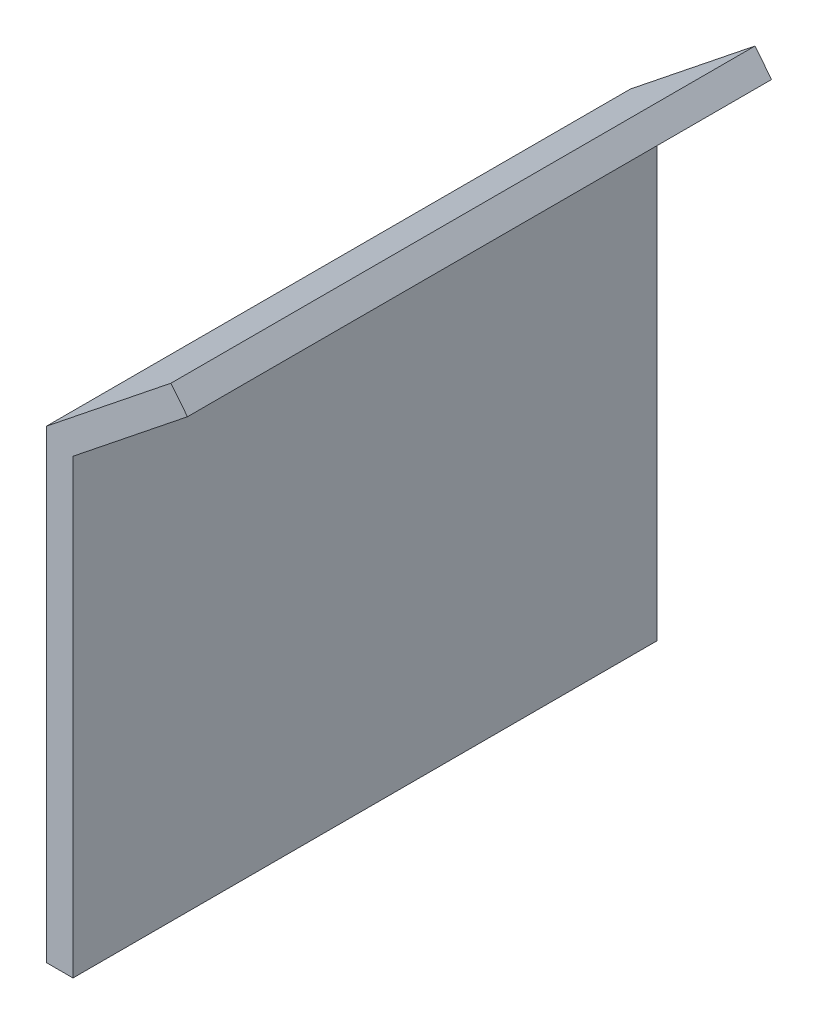
ISO-10303-21;
HEADER;
FILE_DESCRIPTION(('STEP AP214'),'2;1');
FILE_NAME('part.step','',(''),(''),'','','');
FILE_SCHEMA(('AUTOMOTIVE_DESIGN { 1 0 10303 214 1 1 1 1 }'));
ENDSEC;
DATA;
#1=APPLICATION_CONTEXT('core data for automotive mechanical design processes');
#2=APPLICATION_PROTOCOL_DEFINITION('international standard','automotive_design',2000,#1);
#3=PRODUCT_CONTEXT('',#1,'mechanical');
#4=PRODUCT('Part','Part','',(#3));
#5=PRODUCT_RELATED_PRODUCT_CATEGORY('part','',(#4));
#6=PRODUCT_DEFINITION_FORMATION('','',#4);
#7=PRODUCT_DEFINITION_CONTEXT('part definition',#1,'design');
#8=PRODUCT_DEFINITION('design','',#6,#7);
#9=PRODUCT_DEFINITION_SHAPE('','',#8);
#10=(LENGTH_UNIT() NAMED_UNIT(*) SI_UNIT(.MILLI.,.METRE.));
#11=(NAMED_UNIT(*) PLANE_ANGLE_UNIT() SI_UNIT($,.RADIAN.));
#12=(NAMED_UNIT(*) SI_UNIT($,.STERADIAN.) SOLID_ANGLE_UNIT());
#13=UNCERTAINTY_MEASURE_WITH_UNIT(LENGTH_MEASURE(1.E-05),#10,'distance_accuracy_value','');
#14=(GEOMETRIC_REPRESENTATION_CONTEXT(3) GLOBAL_UNCERTAINTY_ASSIGNED_CONTEXT((#13)) GLOBAL_UNIT_ASSIGNED_CONTEXT((#10,
#11,#12)) REPRESENTATION_CONTEXT('',''));
#15=CARTESIAN_POINT('',(0.,0.,0.));
#16=DIRECTION('',(0.,0.,1.));
#17=DIRECTION('',(1.,0.,0.));
#18=AXIS2_PLACEMENT_3D('',#15,#16,#17);
#19=CARTESIAN_POINT('',(0.,0.,0.));
#20=DIRECTION('',(0.,0.,1.));
#21=DIRECTION('',(1.,0.,0.));
#22=AXIS2_PLACEMENT_3D('',#19,#20,#21);
#23=PLANE('',#22);
#24=DIRECTION('',(1.,0.,0.));
#25=VECTOR('',#24,1.);
#26=CARTESIAN_POINT('',(-97.8410238780608,50.4529528721964,0.));
#27=LINE('',#26,#25);
#28=CARTESIAN_POINT('',(-97.8410238780608,50.4529528721964,0.));
#29=VERTEX_POINT('',#28);
#30=CARTESIAN_POINT('',(-95.8410238780608,50.4529528721963,0.));
#31=VERTEX_POINT('',#30);
#32=EDGE_CURVE('E101',#29,#31,#27,.T.);
#33=ORIENTED_EDGE('',*,*,#32,.F.);
#34=DIRECTION('',(0.,-1.,0.));
#35=VECTOR('',#34,1.);
#36=CARTESIAN_POINT('',(-97.8410238780608,85.4529528721964,0.));
#37=LINE('',#36,#35);
#38=CARTESIAN_POINT('',(-97.8410238780608,85.4529528721964,0.));
#39=VERTEX_POINT('',#38);
#40=EDGE_CURVE('E119',#39,#29,#37,.T.);
#41=ORIENTED_EDGE('',*,*,#40,.F.);
#42=DIRECTION('',(-0.781290028461833,-0.624168159574091,0.));
#43=VECTOR('',#42,1.);
#44=CARTESIAN_POINT('',(-88.4655435365188,92.9429707870855,0.));
#45=LINE('',#44,#43);
#46=CARTESIAN_POINT('',(-88.4655435365188,92.9429707870855,0.));
#47=VERTEX_POINT('',#46);
#48=EDGE_CURVE('E116',#47,#39,#45,.T.);
#49=ORIENTED_EDGE('',*,*,#48,.F.);
#50=DIRECTION('',(-0.624168159574091,0.781290028461833,0.));
#51=VECTOR('',#50,1.);
#52=CARTESIAN_POINT('',(-87.2172072173706,91.3803907301618,0.));
#53=LINE('',#52,#51);
#54=CARTESIAN_POINT('',(-87.2172072173706,91.3803907301618,0.));
#55=VERTEX_POINT('',#54);
#56=EDGE_CURVE('E113',#55,#47,#53,.T.);
#57=ORIENTED_EDGE('',*,*,#56,.F.);
#58=DIRECTION('',(0.781290028461832,0.624168159574092,0.));
#59=VECTOR('',#58,1.);
#60=CARTESIAN_POINT('',(-95.8410238780608,84.4908726542629,0.));
#61=LINE('',#60,#59);
#62=CARTESIAN_POINT('',(-95.8410238780608,84.4908726542629,0.));
#63=VERTEX_POINT('',#62);
#64=EDGE_CURVE('E104',#63,#55,#61,.T.);
#65=ORIENTED_EDGE('',*,*,#64,.F.);
#66=DIRECTION('',(0.,1.,0.));
#67=VECTOR('',#66,1.);
#68=CARTESIAN_POINT('',(-95.8410238780608,50.4529528721963,0.));
#69=LINE('',#68,#67);
#70=EDGE_CURVE('E93',#31,#63,#69,.T.);
#71=ORIENTED_EDGE('',*,*,#70,.F.);
#72=EDGE_LOOP('',(#33,#41,#49,#57,#65,#71));
#73=FACE_BOUND('',#72,.T.);
#74=ADVANCED_FACE('F37',(#73),#23,.F.);
#75=CARTESIAN_POINT('',(-97.8410238780608,85.4529528721964,87.7980262437425));
#76=DIRECTION('',(1.,0.,0.));
#77=DIRECTION('',(0.,0.,-1.));
#78=AXIS2_PLACEMENT_3D('',#75,#76,#77);
#79=PLANE('',#78);
#80=DIRECTION('',(0.,0.,-1.));
#81=VECTOR('',#80,1.);
#82=CARTESIAN_POINT('',(-97.8410238780608,50.4529528721964,87.7980262437425));
#83=LINE('',#82,#81);
#84=CARTESIAN_POINT('',(-97.8410238780608,50.4529528721964,44.));
#85=VERTEX_POINT('',#84);
#86=EDGE_CURVE('E107',#85,#29,#83,.T.);
#87=ORIENTED_EDGE('',*,*,#86,.F.);
#88=DIRECTION('',(0.,1.,0.));
#89=VECTOR('',#88,1.);
#90=CARTESIAN_POINT('',(-97.8410238780608,85.4529528721964,44.));
#91=LINE('',#90,#89);
#92=CARTESIAN_POINT('',(-97.8410238780608,85.4529528721964,44.));
#93=VERTEX_POINT('',#92);
#94=EDGE_CURVE('E41',#85,#93,#91,.T.);
#95=ORIENTED_EDGE('',*,*,#94,.T.);
#96=DIRECTION('',(0.,0.,-1.));
#97=VECTOR('',#96,1.);
#98=CARTESIAN_POINT('',(-97.8410238780608,85.4529528721964,87.7980262437425));
#99=LINE('',#98,#97);
#100=EDGE_CURVE('E122',#93,#39,#99,.T.);
#101=ORIENTED_EDGE('',*,*,#100,.T.);
#102=ORIENTED_EDGE('',*,*,#40,.T.);
#103=EDGE_LOOP('',(#87,#95,#101,#102));
#104=FACE_BOUND('',#103,.T.);
#105=ADVANCED_FACE('F141',(#104),#79,.F.);
#106=CARTESIAN_POINT('',(-88.4655435365188,92.9429707870855,87.7980262437425));
#107=DIRECTION('',(0.624168159574091,-0.781290028461833,0.));
#108=DIRECTION('',(0.781290028461833,0.624168159574091,0.));
#109=AXIS2_PLACEMENT_3D('',#106,#107,#108);
#110=PLANE('',#109);
#111=ORIENTED_EDGE('',*,*,#100,.F.);
#112=DIRECTION('',(0.781290028461833,0.624168159574091,0.));
#113=VECTOR('',#112,1.);
#114=CARTESIAN_POINT('',(-88.4655435365188,92.9429707870855,44.));
#115=LINE('',#114,#113);
#116=CARTESIAN_POINT('',(-88.4655435365188,92.9429707870855,44.));
#117=VERTEX_POINT('',#116);
#118=EDGE_CURVE('E133',#93,#117,#115,.T.);
#119=ORIENTED_EDGE('',*,*,#118,.T.);
#120=DIRECTION('',(0.,0.,-1.));
#121=VECTOR('',#120,1.);
#122=CARTESIAN_POINT('',(-88.4655435365188,92.9429707870855,87.7980262437425));
#123=LINE('',#122,#121);
#124=EDGE_CURVE('E124',#117,#47,#123,.T.);
#125=ORIENTED_EDGE('',*,*,#124,.T.);
#126=ORIENTED_EDGE('',*,*,#48,.T.);
#127=EDGE_LOOP('',(#111,#119,#125,#126));
#128=FACE_BOUND('',#127,.T.);
#129=ADVANCED_FACE('F144',(#128),#110,.F.);
#130=CARTESIAN_POINT('',(-87.2172072173706,91.3803907301618,87.7980262437425));
#131=DIRECTION('',(-0.781290028461833,-0.624168159574091,0.));
#132=DIRECTION('',(0.624168159574091,-0.781290028461833,0.));
#133=AXIS2_PLACEMENT_3D('',#130,#131,#132);
#134=PLANE('',#133);
#135=ORIENTED_EDGE('',*,*,#124,.F.);
#136=DIRECTION('',(0.624168159574091,-0.781290028461833,0.));
#137=VECTOR('',#136,1.);
#138=CARTESIAN_POINT('',(-87.2172072173706,91.3803907301618,44.));
#139=LINE('',#138,#137);
#140=CARTESIAN_POINT('',(-87.2172072173706,91.3803907301618,44.));
#141=VERTEX_POINT('',#140);
#142=EDGE_CURVE('E131',#117,#141,#139,.T.);
#143=ORIENTED_EDGE('',*,*,#142,.T.);
#144=DIRECTION('',(0.,0.,-1.));
#145=VECTOR('',#144,1.);
#146=CARTESIAN_POINT('',(-87.2172072173706,91.3803907301618,87.7980262437425));
#147=LINE('',#146,#145);
#148=EDGE_CURVE('E126',#141,#55,#147,.T.);
#149=ORIENTED_EDGE('',*,*,#148,.T.);
#150=ORIENTED_EDGE('',*,*,#56,.T.);
#151=EDGE_LOOP('',(#135,#143,#149,#150));
#152=FACE_BOUND('',#151,.T.);
#153=ADVANCED_FACE('F147',(#152),#134,.F.);
#154=CARTESIAN_POINT('',(-95.8410238780608,84.4908726542629,87.7980262437425));
#155=DIRECTION('',(-0.624168159574092,0.781290028461832,0.));
#156=DIRECTION('',(-0.781290028461832,-0.624168159574092,0.));
#157=AXIS2_PLACEMENT_3D('',#154,#155,#156);
#158=PLANE('',#157);
#159=ORIENTED_EDGE('',*,*,#148,.F.);
#160=DIRECTION('',(-0.781290028461832,-0.624168159574092,0.));
#161=VECTOR('',#160,1.);
#162=CARTESIAN_POINT('',(-95.8410238780608,84.4908726542629,44.));
#163=LINE('',#162,#161);
#164=CARTESIAN_POINT('',(-95.8410238780608,84.4908726542629,44.));
#165=VERTEX_POINT('',#164);
#166=EDGE_CURVE('E58',#141,#165,#163,.T.);
#167=ORIENTED_EDGE('',*,*,#166,.T.);
#168=DIRECTION('',(0.,0.,-1.));
#169=VECTOR('',#168,1.);
#170=CARTESIAN_POINT('',(-95.8410238780608,84.4908726542629,87.7980262437425));
#171=LINE('',#170,#169);
#172=EDGE_CURVE('E97',#165,#63,#171,.T.);
#173=ORIENTED_EDGE('',*,*,#172,.T.);
#174=ORIENTED_EDGE('',*,*,#64,.T.);
#175=EDGE_LOOP('',(#159,#167,#173,#174));
#176=FACE_BOUND('',#175,.T.);
#177=ADVANCED_FACE('F129',(#176),#158,.F.);
#178=CARTESIAN_POINT('',(-95.8410238780608,50.4529528721963,87.7980262437425));
#179=DIRECTION('',(-1.,0.,0.));
#180=DIRECTION('',(0.,0.,1.));
#181=AXIS2_PLACEMENT_3D('',#178,#179,#180);
#182=PLANE('',#181);
#183=ORIENTED_EDGE('',*,*,#172,.F.);
#184=DIRECTION('',(0.,-1.,0.));
#185=VECTOR('',#184,1.);
#186=CARTESIAN_POINT('',(-95.8410238780608,50.4529528721963,44.));
#187=LINE('',#186,#185);
#188=CARTESIAN_POINT('',(-95.8410238780608,50.4529528721963,44.));
#189=VERTEX_POINT('',#188);
#190=EDGE_CURVE('E46',#165,#189,#187,.T.);
#191=ORIENTED_EDGE('',*,*,#190,.T.);
#192=DIRECTION('',(0.,0.,-1.));
#193=VECTOR('',#192,1.);
#194=CARTESIAN_POINT('',(-95.8410238780608,50.4529528721963,87.7980262437425));
#195=LINE('',#194,#193);
#196=EDGE_CURVE('E90',#189,#31,#195,.T.);
#197=ORIENTED_EDGE('',*,*,#196,.T.);
#198=ORIENTED_EDGE('',*,*,#70,.T.);
#199=EDGE_LOOP('',(#183,#191,#197,#198));
#200=FACE_BOUND('',#199,.T.);
#201=ADVANCED_FACE('F92',(#200),#182,.F.);
#202=CARTESIAN_POINT('',(-97.8410238780608,50.4529528721964,87.7980262437425));
#203=DIRECTION('',(0.,1.,0.));
#204=DIRECTION('',(-1.,0.,0.));
#205=AXIS2_PLACEMENT_3D('',#202,#203,#204);
#206=PLANE('',#205);
#207=ORIENTED_EDGE('',*,*,#196,.F.);
#208=DIRECTION('',(-1.,0.,0.));
#209=VECTOR('',#208,1.);
#210=CARTESIAN_POINT('',(-97.8410238780608,50.4529528721964,44.));
#211=LINE('',#210,#209);
#212=EDGE_CURVE('E11',#189,#85,#211,.T.);
#213=ORIENTED_EDGE('',*,*,#212,.T.);
#214=ORIENTED_EDGE('',*,*,#86,.T.);
#215=ORIENTED_EDGE('',*,*,#32,.T.);
#216=EDGE_LOOP('',(#207,#213,#214,#215));
#217=FACE_BOUND('',#216,.T.);
#218=ADVANCED_FACE('F39',(#217),#206,.F.);
#219=CARTESIAN_POINT('',(-89.6980017258023,52.6969142333809,44.));
#220=DIRECTION('',(0.,0.,-1.));
#221=DIRECTION('',(-0.928613678953647,0.37104802284903,0.));
#222=AXIS2_PLACEMENT_3D('',#219,#220,#221);
#223=PLANE('',#222);
#224=ORIENTED_EDGE('',*,*,#190,.F.);
#225=ORIENTED_EDGE('',*,*,#166,.F.);
#226=ORIENTED_EDGE('',*,*,#142,.F.);
#227=ORIENTED_EDGE('',*,*,#118,.F.);
#228=ORIENTED_EDGE('',*,*,#94,.F.);
#229=ORIENTED_EDGE('',*,*,#212,.F.);
#230=EDGE_LOOP('',(#224,#225,#226,#227,#228,#229));
#231=FACE_BOUND('',#230,.T.);
#232=ADVANCED_FACE('F142',(#231),#223,.F.);
#233=CLOSED_SHELL('',(#74,#105,#129,#153,#177,#201,#218,#232));
#234=MANIFOLD_SOLID_BREP('B2',#233);
#235=ADVANCED_BREP_SHAPE_REPRESENTATION('',(#18,#234),#14);
#236=SHAPE_DEFINITION_REPRESENTATION(#9,#235);
ENDSEC;
END-ISO-10303-21;
